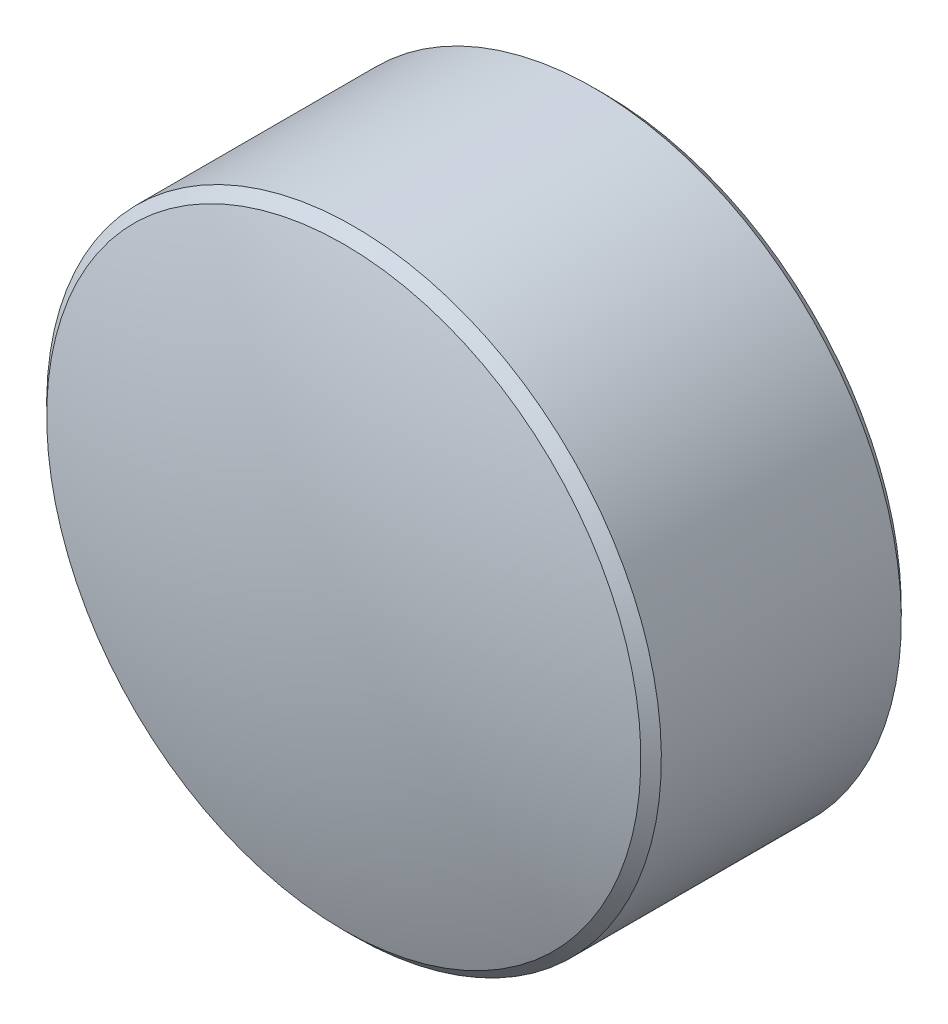
ISO-10303-21;
HEADER;
FILE_DESCRIPTION(('STEP AP214'),'2;1');
FILE_NAME('part.step','',(''),(''),'','','');
FILE_SCHEMA(('AUTOMOTIVE_DESIGN { 1 0 10303 214 1 1 1 1 }'));
ENDSEC;
DATA;
#1=APPLICATION_CONTEXT('core data for automotive mechanical design processes');
#2=APPLICATION_PROTOCOL_DEFINITION('international standard','automotive_design',2000,#1);
#3=PRODUCT_CONTEXT('',#1,'mechanical');
#4=PRODUCT('Part','Part','',(#3));
#5=PRODUCT_RELATED_PRODUCT_CATEGORY('part','',(#4));
#6=PRODUCT_DEFINITION_FORMATION('','',#4);
#7=PRODUCT_DEFINITION_CONTEXT('part definition',#1,'design');
#8=PRODUCT_DEFINITION('design','',#6,#7);
#9=PRODUCT_DEFINITION_SHAPE('','',#8);
#10=(LENGTH_UNIT() NAMED_UNIT(*) SI_UNIT(.MILLI.,.METRE.));
#11=(NAMED_UNIT(*) PLANE_ANGLE_UNIT() SI_UNIT($,.RADIAN.));
#12=(NAMED_UNIT(*) SI_UNIT($,.STERADIAN.) SOLID_ANGLE_UNIT());
#13=UNCERTAINTY_MEASURE_WITH_UNIT(LENGTH_MEASURE(1.E-05),#10,'distance_accuracy_value','');
#14=(GEOMETRIC_REPRESENTATION_CONTEXT(3) GLOBAL_UNCERTAINTY_ASSIGNED_CONTEXT((#13)) GLOBAL_UNIT_ASSIGNED_CONTEXT((#10,
#11,#12)) REPRESENTATION_CONTEXT('',''));
#15=CARTESIAN_POINT('',(0.,0.,0.));
#16=DIRECTION('',(0.,0.,1.));
#17=DIRECTION('',(1.,0.,0.));
#18=AXIS2_PLACEMENT_3D('',#15,#16,#17);
#19=CARTESIAN_POINT('',(0.781594708298141,1.54260620168572,1.74683059800125));
#20=DIRECTION('',(0.,0.,1.));
#21=DIRECTION('',(0.,-1.,0.));
#22=AXIS2_PLACEMENT_3D('',#19,#20,#21);
#23=PLANE('',#22);
#24=CARTESIAN_POINT('',(0.781594708298141,1.54260620168572,1.74683059800125));
#25=DIRECTION('',(0.,0.,1.));
#26=DIRECTION('',(0.,-1.,0.));
#27=AXIS2_PLACEMENT_3D('',#24,#25,#26);
#28=CIRCLE('',#27,1.45);
#29=CARTESIAN_POINT('',(0.781594708298141,0.0926062016857166,1.74683059800125));
#30=VERTEX_POINT('',#29);
#31=EDGE_CURVE('E9',#30,#30,#28,.F.);
#32=ORIENTED_EDGE('',*,*,#31,.T.);
#33=EDGE_LOOP('',(#32));
#34=FACE_BOUND('',#33,.T.);
#35=ADVANCED_FACE('F13',(#34),#23,.F.);
#36=CARTESIAN_POINT('',(0.781594708298141,1.54260620168572,3.24683059800125));
#37=DIRECTION('',(0.,0.,1.));
#38=DIRECTION('',(0.,-1.,0.));
#39=AXIS2_PLACEMENT_3D('',#36,#37,#38);
#40=CYLINDRICAL_SURFACE('',#39,1.5);
#41=CARTESIAN_POINT('',(0.781594708298141,1.54260620168572,1.79683059800125));
#42=DIRECTION('',(0.,0.,1.));
#43=DIRECTION('',(0.,-1.,0.));
#44=AXIS2_PLACEMENT_3D('',#41,#42,#43);
#45=CIRCLE('',#44,1.5);
#46=CARTESIAN_POINT('',(0.781594708298141,0.0426062016857169,1.79683059800125));
#47=VERTEX_POINT('',#46);
#48=EDGE_CURVE('E20',#47,#47,#45,.T.);
#49=ORIENTED_EDGE('',*,*,#48,.T.);
#50=EDGE_LOOP('',(#49));
#51=FACE_BOUND('',#50,.T.);
#52=CARTESIAN_POINT('',(0.781594708298141,1.54260620168572,2.96797828478274));
#53=DIRECTION('',(0.,0.,1.));
#54=DIRECTION('',(0.,-1.,0.));
#55=AXIS2_PLACEMENT_3D('',#52,#53,#54);
#56=CIRCLE('',#55,1.5);
#57=CARTESIAN_POINT('',(0.781594708298141,0.0426062016857169,2.96797828478274));
#58=VERTEX_POINT('',#57);
#59=EDGE_CURVE('E24',#58,#58,#56,.T.);
#60=ORIENTED_EDGE('',*,*,#59,.F.);
#61=EDGE_LOOP('',(#60));
#62=FACE_BOUND('',#61,.T.);
#63=ADVANCED_FACE('F39',(#51,#62),#40,.T.);
#64=CARTESIAN_POINT('',(0.781594708298141,1.54260620168572,2.96797828478274));
#65=DIRECTION('',(0.,0.,-1.));
#66=DIRECTION('',(0.,1.,0.));
#67=AXIS2_PLACEMENT_3D('',#64,#65,#66);
#68=CONICAL_SURFACE('',#67,1.5,0.785398163397453);
#69=CARTESIAN_POINT('',(0.781594708298141,1.54260620168572,3.01797828478274));
#70=DIRECTION('',(0.,0.,1.));
#71=DIRECTION('',(0.,-1.,0.));
#72=AXIS2_PLACEMENT_3D('',#69,#70,#71);
#73=CIRCLE('',#72,1.45);
#74=CARTESIAN_POINT('',(0.781594708298141,0.0926062016857172,3.01797828478274));
#75=VERTEX_POINT('',#74);
#76=EDGE_CURVE('E28',#75,#75,#73,.T.);
#77=ORIENTED_EDGE('',*,*,#76,.F.);
#78=EDGE_LOOP('',(#77));
#79=FACE_BOUND('',#78,.T.);
#80=ORIENTED_EDGE('',*,*,#59,.T.);
#81=EDGE_LOOP('',(#80));
#82=FACE_BOUND('',#81,.T.);
#83=ADVANCED_FACE('F36',(#79,#82),#68,.T.);
#84=CARTESIAN_POINT('',(0.781594708298141,1.54260620168572,-1.46116940199875));
#85=DIRECTION('',(0.,0.,1.));
#86=DIRECTION('',(0.,1.,0.));
#87=AXIS2_PLACEMENT_3D('',#84,#85,#86);
#88=SPHERICAL_SURFACE('',#87,4.708);
#89=ORIENTED_EDGE('',*,*,#76,.T.);
#90=EDGE_LOOP('',(#89));
#91=FACE_BOUND('',#90,.T.);
#92=ADVANCED_FACE('F34',(#91),#88,.T.);
#93=CARTESIAN_POINT('',(0.781594708298141,1.54260620168572,1.79683059800125));
#94=DIRECTION('',(0.,0.,1.));
#95=DIRECTION('',(0.,-1.,0.));
#96=AXIS2_PLACEMENT_3D('',#93,#94,#95);
#97=CONICAL_SURFACE('',#96,1.5,0.78539816339745);
#98=ORIENTED_EDGE('',*,*,#31,.F.);
#99=EDGE_LOOP('',(#98));
#100=FACE_BOUND('',#99,.T.);
#101=ORIENTED_EDGE('',*,*,#48,.F.);
#102=EDGE_LOOP('',(#101));
#103=FACE_BOUND('',#102,.T.);
#104=ADVANCED_FACE('F15',(#100,#103),#97,.T.);
#105=CLOSED_SHELL('',(#35,#63,#83,#92,#104));
#106=MANIFOLD_SOLID_BREP('B1',#105);
#107=ADVANCED_BREP_SHAPE_REPRESENTATION('',(#18,#106),#14);
#108=SHAPE_DEFINITION_REPRESENTATION(#9,#107);
ENDSEC;
END-ISO-10303-21;
